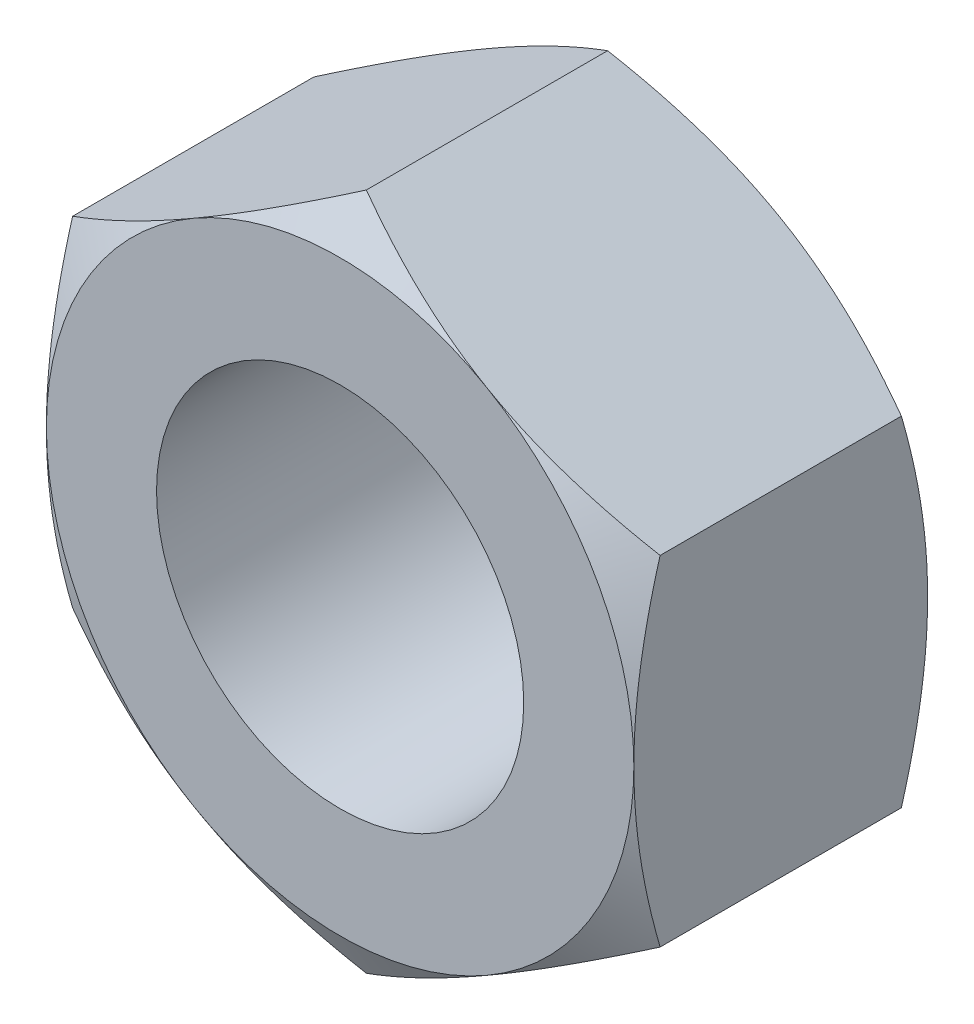
ISO-10303-21;
HEADER;
FILE_DESCRIPTION(('STEP AP214'),'2;1');
FILE_NAME('part.step','',(''),(''),'','','');
FILE_SCHEMA(('AUTOMOTIVE_DESIGN { 1 0 10303 214 1 1 1 1 }'));
ENDSEC;
DATA;
#1=APPLICATION_CONTEXT('core data for automotive mechanical design processes');
#2=APPLICATION_PROTOCOL_DEFINITION('international standard','automotive_design',2000,#1);
#3=PRODUCT_CONTEXT('',#1,'mechanical');
#4=PRODUCT('Part','Part','',(#3));
#5=PRODUCT_RELATED_PRODUCT_CATEGORY('part','',(#4));
#6=PRODUCT_DEFINITION_FORMATION('','',#4);
#7=PRODUCT_DEFINITION_CONTEXT('part definition',#1,'design');
#8=PRODUCT_DEFINITION('design','',#6,#7);
#9=PRODUCT_DEFINITION_SHAPE('','',#8);
#10=(LENGTH_UNIT() NAMED_UNIT(*) SI_UNIT(.MILLI.,.METRE.));
#11=(NAMED_UNIT(*) PLANE_ANGLE_UNIT() SI_UNIT($,.RADIAN.));
#12=(NAMED_UNIT(*) SI_UNIT($,.STERADIAN.) SOLID_ANGLE_UNIT());
#13=UNCERTAINTY_MEASURE_WITH_UNIT(LENGTH_MEASURE(1.E-05),#10,'distance_accuracy_value','');
#14=(GEOMETRIC_REPRESENTATION_CONTEXT(3) GLOBAL_UNCERTAINTY_ASSIGNED_CONTEXT((#13)) GLOBAL_UNIT_ASSIGNED_CONTEXT((#10,
#11,#12)) REPRESENTATION_CONTEXT('',''));
#15=CARTESIAN_POINT('',(0.,0.,0.));
#16=DIRECTION('',(0.,0.,1.));
#17=DIRECTION('',(1.,0.,0.));
#18=AXIS2_PLACEMENT_3D('',#15,#16,#17);
#19=CARTESIAN_POINT('',(-2.,-1.15470053837925,2.));
#20=DIRECTION('',(0.5,0.866025403784438,0.));
#21=DIRECTION('',(-0.866025403784439,0.5,0.));
#22=AXIS2_PLACEMENT_3D('',#19,#20,#21);
#23=PLANE('',#22);
#24=CARTESIAN_POINT('',(0.0002,-2.30951654681234,0.178699466620498));
#25=CARTESIAN_POINT('',(-0.0876912629000601,-2.25877250251758,0.149389536100679));
#26=CARTESIAN_POINT('',(-0.176341194473591,-2.20759044065996,0.122732851980467));
#27=CARTESIAN_POINT('',(-0.355176246997802,-2.10433997494456,0.0762024910207213));
#28=CARTESIAN_POINT('',(-0.445364546505036,-2.05226973594631,0.0563452763827794));
#29=CARTESIAN_POINT('',(-0.624623385763306,-1.94877459684592,0.0254334640232529));
#30=CARTESIAN_POINT('',(-0.713666338226304,-1.89736562427197,0.0141731515985315));
#31=CARTESIAN_POINT('',(-0.892171397785043,-1.79430568008402,0.000728662594642223));
#32=CARTESIAN_POINT('',(-0.981632855703958,-1.74265508327244,-0.00146664504653146));
#33=CARTESIAN_POINT('',(-1.1488083535488,-1.64613626458981,0.00309098933064913));
#34=CARTESIAN_POINT('',(-1.22654737026578,-1.60125362236173,0.0087248746870149));
#35=CARTESIAN_POINT('',(-1.38151891453613,-1.51178075956051,0.0265838952608285));
#36=CARTESIAN_POINT('',(-1.4587509057412,-1.46719084864821,0.0388151360234394));
#37=CARTESIAN_POINT('',(-1.6140421864822,-1.37753338590959,0.0693934368676097));
#38=CARTESIAN_POINT('',(-1.69208181310738,-1.33247718647009,0.0878701670657158));
#39=CARTESIAN_POINT('',(-1.84699686569213,-1.24303693915875,0.129805518212856));
#40=CARTESIAN_POINT('',(-1.92387427762312,-1.1986517446858,0.153254280492313));
#41=CARTESIAN_POINT('',(-2.0002,-1.15458506832541,0.178699466620497));
#42=B_SPLINE_CURVE_WITH_KNOTS('',3,(#24,#25,#26,#27,#28,#29,#30,#31,#32,#33,#34,#35,#36,#37,#38,
#39,#40,#41),.UNSPECIFIED.,.F.,.F.,(4,2,2,2,2,2,2,2,4),(0.,0.31703182469561,0.634825876346563,
0.944753967652636,1.25430138000371,1.52387047293094,1.79368946861028,2.06949491027634,
2.34475850821472),.UNSPECIFIED.);
#43=CARTESIAN_POINT('',(0.,-2.3094010767585,0.178632794954081));
#44=VERTEX_POINT('',#43);
#45=CARTESIAN_POINT('',(-1.,-1.73205080756888,0.));
#46=VERTEX_POINT('',#45);
#47=EDGE_CURVE('E266',#44,#46,#42,.T.);
#48=ORIENTED_EDGE('',*,*,#47,.F.);
#49=DIRECTION('',(0.,0.,-1.));
#50=VECTOR('',#49,1.);
#51=CARTESIAN_POINT('',(0.,-2.3094010767585,2.));
#52=LINE('',#51,#50);
#53=CARTESIAN_POINT('',(0.,-2.3094010767585,1.82136720504592));
#54=VERTEX_POINT('',#53);
#55=EDGE_CURVE('E309',#54,#44,#52,.T.);
#56=ORIENTED_EDGE('',*,*,#55,.F.);
#57=CARTESIAN_POINT('',(-2.0002,-1.15458506832541,1.8213005333795));
#58=CARTESIAN_POINT('',(-1.91230873709994,-1.20532911262018,1.85061046389932));
#59=CARTESIAN_POINT('',(-1.82365880552641,-1.2565111744778,1.87726714801953));
#60=CARTESIAN_POINT('',(-1.6448237530022,-1.35976164019319,1.92379750897928));
#61=CARTESIAN_POINT('',(-1.55463545349496,-1.41183187919145,1.94365472361722));
#62=CARTESIAN_POINT('',(-1.37537661423669,-1.51532701829183,1.97456653597675));
#63=CARTESIAN_POINT('',(-1.2863336617737,-1.56673599086578,1.98582684840147));
#64=CARTESIAN_POINT('',(-1.10782860221496,-1.66979593505373,1.99927133740536));
#65=CARTESIAN_POINT('',(-1.01836714429604,-1.72144653186531,2.00146664504653));
#66=CARTESIAN_POINT('',(-0.851191646451202,-1.81796535054794,1.99690901066935));
#67=CARTESIAN_POINT('',(-0.773452629734216,-1.86284799277603,1.99127512531299));
#68=CARTESIAN_POINT('',(-0.618481085463867,-1.95232085557725,1.97341610473917));
#69=CARTESIAN_POINT('',(-0.541249094258802,-1.99691076648954,1.96118486397656));
#70=CARTESIAN_POINT('',(-0.385957813517799,-2.08656822922816,1.93060656313239));
#71=CARTESIAN_POINT('',(-0.30791818689262,-2.13162442866767,1.91212983293428));
#72=CARTESIAN_POINT('',(-0.153003134307865,-2.221064675979,1.87019448178714));
#73=CARTESIAN_POINT('',(-0.0761257223768796,-2.26544987045196,1.84674571950769));
#74=CARTESIAN_POINT('',(0.000200000000000281,-2.30951654681234,1.8213005333795));
#75=B_SPLINE_CURVE_WITH_KNOTS('',3,(#57,#58,#59,#60,#61,#62,#63,#64,#65,#66,#67,#68,#69,#70,#71,
#72,#73,#74),.UNSPECIFIED.,.F.,.F.,(4,2,2,2,2,2,2,2,4),(0.,0.31703182469561,0.634825876346563,
0.944753967652636,1.25430138000371,1.52387047293094,1.79368946861028,2.06949491027634,
2.34475850821472),.UNSPECIFIED.);
#76=CARTESIAN_POINT('',(-1.,-1.73205080756888,2.));
#77=VERTEX_POINT('',#76);
#78=EDGE_CURVE('E216',#77,#54,#75,.T.);
#79=ORIENTED_EDGE('',*,*,#78,.F.);
#80=CARTESIAN_POINT('',(-2.,-1.15470053837931,1.82136720504596));
#81=VERTEX_POINT('',#80);
#82=EDGE_CURVE('E292',#81,#77,#75,.T.);
#83=ORIENTED_EDGE('',*,*,#82,.F.);
#84=DIRECTION('',(0.,0.,-1.));
#85=VECTOR('',#84,1.);
#86=CARTESIAN_POINT('',(-2.,-1.15470053837925,2.));
#87=LINE('',#86,#85);
#88=CARTESIAN_POINT('',(-2.,-1.15470053837931,0.178632794954043));
#89=VERTEX_POINT('',#88);
#90=EDGE_CURVE('E289',#81,#89,#87,.T.);
#91=ORIENTED_EDGE('',*,*,#90,.T.);
#92=EDGE_CURVE('E253',#46,#89,#42,.T.);
#93=ORIENTED_EDGE('',*,*,#92,.F.);
#94=EDGE_LOOP('',(#48,#56,#79,#83,#91,#93));
#95=FACE_BOUND('',#94,.T.);
#96=ADVANCED_FACE('F36',(#95),#23,.F.);
#97=CARTESIAN_POINT('',(0.,-2.3094010767585,2.));
#98=DIRECTION('',(-0.5,0.866025403784439,0.));
#99=DIRECTION('',(-0.866025403784439,-0.5,0.));
#100=AXIS2_PLACEMENT_3D('',#97,#98,#99);
#101=PLANE('',#100);
#102=CARTESIAN_POINT('',(2.0002,-1.15458506832541,0.178699466620498));
#103=CARTESIAN_POINT('',(1.91230873709994,-1.20532911262018,0.149389536100679));
#104=CARTESIAN_POINT('',(1.82365880552641,-1.2565111744778,0.122732851980467));
#105=CARTESIAN_POINT('',(1.6448237530022,-1.35976164019319,0.0762024910207212));
#106=CARTESIAN_POINT('',(1.55463545349496,-1.41183187919145,0.0563452763827793));
#107=CARTESIAN_POINT('',(1.37537661423669,-1.51532701829183,0.0254334640232528));
#108=CARTESIAN_POINT('',(1.2863336617737,-1.56673599086578,0.0141731515985315));
#109=CARTESIAN_POINT('',(1.10782860221496,-1.66979593505373,0.000728662594642224));
#110=CARTESIAN_POINT('',(1.01836714429604,-1.72144653186531,-0.0014666450465315));
#111=CARTESIAN_POINT('',(0.851191646451202,-1.81796535054794,0.00309098933064922));
#112=CARTESIAN_POINT('',(0.773452629734216,-1.86284799277603,0.00872487468701516));
#113=CARTESIAN_POINT('',(0.618481085463867,-1.95232085557725,0.0265838952608289));
#114=CARTESIAN_POINT('',(0.541249094258802,-1.99691076648954,0.0388151360234398));
#115=CARTESIAN_POINT('',(0.385957813517799,-2.08656822922816,0.0693934368676101));
#116=CARTESIAN_POINT('',(0.307918186892621,-2.13162442866767,0.0878701670657161));
#117=CARTESIAN_POINT('',(0.153003134307865,-2.221064675979,0.129805518212856));
#118=CARTESIAN_POINT('',(0.0761257223768798,-2.26544987045196,0.153254280492314));
#119=CARTESIAN_POINT('',(-0.000200000000000301,-2.30951654681234,0.178699466620498));
#120=B_SPLINE_CURVE_WITH_KNOTS('',3,(#102,#103,#104,#105,#106,#107,#108,#109,#110,#111,#112,
#113,#114,#115,#116,#117,#118,#119),.UNSPECIFIED.,.F.,.F.,(4,2,2,2,2,2,2,2,4),(0.,
0.31703182469561,0.634825876346563,0.944753967652636,1.25430138000371,1.52387047293094,
1.79368946861028,2.06949491027634,2.34475850821472),.UNSPECIFIED.);
#121=CARTESIAN_POINT('',(2.,-1.15470053837925,0.178632794954081));
#122=VERTEX_POINT('',#121);
#123=CARTESIAN_POINT('',(1.,-1.73205080756888,0.));
#124=VERTEX_POINT('',#123);
#125=EDGE_CURVE('E144',#122,#124,#120,.T.);
#126=ORIENTED_EDGE('',*,*,#125,.F.);
#127=DIRECTION('',(0.,0.,-1.));
#128=VECTOR('',#127,1.);
#129=CARTESIAN_POINT('',(2.,-1.15470053837925,2.));
#130=LINE('',#129,#128);
#131=CARTESIAN_POINT('',(2.,-1.15470053837931,1.82136720504596));
#132=VERTEX_POINT('',#131);
#133=EDGE_CURVE('E156',#132,#122,#130,.T.);
#134=ORIENTED_EDGE('',*,*,#133,.F.);
#135=CARTESIAN_POINT('',(-0.000200000000000067,-2.30951654681234,1.8213005333795));
#136=CARTESIAN_POINT('',(0.0876912629000601,-2.25877250251758,1.85061046389932));
#137=CARTESIAN_POINT('',(0.176341194473591,-2.20759044065996,1.87726714801953));
#138=CARTESIAN_POINT('',(0.355176246997802,-2.10433997494456,1.92379750897928));
#139=CARTESIAN_POINT('',(0.445364546505036,-2.05226973594631,1.94365472361722));
#140=CARTESIAN_POINT('',(0.624623385763306,-1.94877459684592,1.97456653597675));
#141=CARTESIAN_POINT('',(0.713666338226304,-1.89736562427197,1.98582684840147));
#142=CARTESIAN_POINT('',(0.892171397785043,-1.79430568008402,1.99927133740536));
#143=CARTESIAN_POINT('',(0.981632855703958,-1.74265508327244,2.00146664504653));
#144=CARTESIAN_POINT('',(1.1488083535488,-1.64613626458981,1.99690901066935));
#145=CARTESIAN_POINT('',(1.22654737026578,-1.60125362236173,1.99127512531299));
#146=CARTESIAN_POINT('',(1.38151891453613,-1.51178075956051,1.97341610473917));
#147=CARTESIAN_POINT('',(1.4587509057412,-1.46719084864821,1.96118486397656));
#148=CARTESIAN_POINT('',(1.6140421864822,-1.37753338590959,1.93060656313239));
#149=CARTESIAN_POINT('',(1.69208181310738,-1.33247718647009,1.91212983293428));
#150=CARTESIAN_POINT('',(1.84699686569214,-1.24303693915875,1.87019448178714));
#151=CARTESIAN_POINT('',(1.92387427762312,-1.1986517446858,1.84674571950769));
#152=CARTESIAN_POINT('',(2.0002,-1.15458506832541,1.8213005333795));
#153=B_SPLINE_CURVE_WITH_KNOTS('',3,(#135,#136,#137,#138,#139,#140,#141,#142,#143,#144,#145,
#146,#147,#148,#149,#150,#151,#152),.UNSPECIFIED.,.F.,.F.,(4,2,2,2,2,2,2,2,4),(0.,
0.31703182469561,0.634825876346563,0.944753967652636,1.25430138000371,1.52387047293094,
1.79368946861028,2.06949491027634,2.34475850821472),.UNSPECIFIED.);
#154=CARTESIAN_POINT('',(1.,-1.73205080756888,2.));
#155=VERTEX_POINT('',#154);
#156=EDGE_CURVE('E199',#155,#132,#153,.T.);
#157=ORIENTED_EDGE('',*,*,#156,.F.);
#158=EDGE_CURVE('E333',#54,#155,#153,.T.);
#159=ORIENTED_EDGE('',*,*,#158,.F.);
#160=ORIENTED_EDGE('',*,*,#55,.T.);
#161=EDGE_CURVE('E166',#124,#44,#120,.T.);
#162=ORIENTED_EDGE('',*,*,#161,.F.);
#163=EDGE_LOOP('',(#126,#134,#157,#159,#160,#162));
#164=FACE_BOUND('',#163,.T.);
#165=ADVANCED_FACE('F179',(#164),#101,.F.);
#166=CARTESIAN_POINT('',(2.,-1.15470053837925,2.));
#167=DIRECTION('',(-1.,0.,0.));
#168=DIRECTION('',(0.,-1.,0.));
#169=AXIS2_PLACEMENT_3D('',#166,#167,#168);
#170=PLANE('',#169);
#171=CARTESIAN_POINT('',(2.,-3.16695367197543,1.00782850269269));
#172=CARTESIAN_POINT('',(2.,-3.07902197526416,0.96491529338985));
#173=CARTESIAN_POINT('',(2.,-2.9908952827537,0.922395125991094));
#174=CARTESIAN_POINT('',(2.,-2.81414842644907,0.8383607333178));
#175=CARTESIAN_POINT('',(2.,-2.72552819295827,0.796846654790504));
#176=CARTESIAN_POINT('',(2.,-2.54726481378445,0.714849235448644));
#177=CARTESIAN_POINT('',(2.,-2.45761875900125,0.67437219827092));
#178=CARTESIAN_POINT('',(2.,-2.2776359990054,0.594989901598798));
#179=CARTESIAN_POINT('',(2.,-2.18729932484827,0.556084571917135));
#180=CARTESIAN_POINT('',(2.,-2.00264742283372,0.478944987647855));
#181=CARTESIAN_POINT('',(2.,-1.90830280795076,0.44078071061596));
#182=CARTESIAN_POINT('',(2.,-1.71855244896371,0.367193126153302));
#183=CARTESIAN_POINT('',(2.,-1.62314679567917,0.331769586163279));
#184=CARTESIAN_POINT('',(2.,-1.43125371410594,0.26453421181959));
#185=CARTESIAN_POINT('',(2.,-1.33476856464363,0.232715936188967));
#186=CARTESIAN_POINT('',(2.,-1.1404157757171,0.173672468100185));
#187=CARTESIAN_POINT('',(2.,-1.04254856096067,0.146445896525398));
#188=CARTESIAN_POINT('',(2.,-0.845921788600807,0.097994569131326));
#189=CARTESIAN_POINT('',(2.,-0.747170823197166,0.0767355710741393));
#190=CARTESIAN_POINT('',(2.,-0.548376289196544,0.0413752685656705));
#191=CARTESIAN_POINT('',(2.,-0.448332866747864,0.0272731619685154));
#192=CARTESIAN_POINT('',(2.,-0.248781070375196,0.00753603700427049));
#193=CARTESIAN_POINT('',(2.,-0.149284287500364,0.00178714028607804));
#194=CARTESIAN_POINT('',(2.,0.0498326704758066,-0.00107345626728786));
#195=CARTESIAN_POINT('',(2.,0.149452846859733,0.0018149344419635));
#196=CARTESIAN_POINT('',(2.,0.38462284335751,0.018587327234583));
#197=CARTESIAN_POINT('',(2.,0.51991483609575,0.0361239388912121));
#198=CARTESIAN_POINT('',(2.,0.788159784938836,0.084225245542518));
#199=CARTESIAN_POINT('',(2.,0.921110572606416,0.114801418471631));
#200=CARTESIAN_POINT('',(2.,1.18747685717518,0.186425271558098));
#201=CARTESIAN_POINT('',(2.,1.32082859088601,0.227704106094186));
#202=CARTESIAN_POINT('',(2.,1.51898260167282,0.294951393872946));
#203=CARTESIAN_POINT('',(2.,1.58471745406577,0.318253638255043));
#204=CARTESIAN_POINT('',(2.,1.71563585585812,0.366357752672725));
#205=CARTESIAN_POINT('',(2.,1.78081941929029,0.391159584405357));
#206=CARTESIAN_POINT('',(2.,1.96047132737881,0.461501040171776));
#207=CARTESIAN_POINT('',(2.,2.07442009684161,0.508364702088242));
#208=CARTESIAN_POINT('',(2.,2.30109986654163,0.604960958336492));
#209=CARTESIAN_POINT('',(2.,2.41383071836308,0.654693897740062));
#210=CARTESIAN_POINT('',(2.,2.63836009784249,0.756327584044141));
#211=CARTESIAN_POINT('',(2.,2.7501582470185,0.808229164085102));
#212=CARTESIAN_POINT('',(2.,2.97297822080944,0.913676041673371));
#213=CARTESIAN_POINT('',(2.,3.0840000198922,0.967221392970891));
#214=CARTESIAN_POINT('',(2.,3.41651309377542,1.1299289124428));
#215=CARTESIAN_POINT('',(2.,3.63707460518763,1.24098839062516));
#216=CARTESIAN_POINT('',(2.,4.07651788965889,1.46623320547477));
#217=CARTESIAN_POINT('',(2.,4.29540004090732,1.58041781023684));
#218=CARTESIAN_POINT('',(2.,4.70796742449767,1.79819557381208));
#219=CARTESIAN_POINT('',(2.,4.90176934503598,1.90156804689578));
#220=CARTESIAN_POINT('',(2.,5.28873234168865,2.10953519768183));
#221=CARTESIAN_POINT('',(2.,5.48189337289715,2.21412995879868));
#222=CARTESIAN_POINT('',(2.,5.86703603383661,2.42384733635444));
#223=CARTESIAN_POINT('',(2.,6.05901941340968,2.52896674297787));
#224=CARTESIAN_POINT('',(2.,6.44258645794321,2.73989383988691));
#225=CARTESIAN_POINT('',(2.,6.63417015570406,2.84570147050149));
#226=CARTESIAN_POINT('',(2.,6.82561474984265,2.951758468002));
#227=B_SPLINE_CURVE_WITH_KNOTS('',3,(#171,#172,#173,#174,#175,#176,#177,#178,#179,#180,#181,
#182,#183,#184,#185,#186,#187,#188,#189,#190,#191,#192,#193,#194,#195,#196,#197,#198,#199,#200,
#201,#202,#203,#204,#205,#206,#207,#208,#209,#210,#211,#212,#213,#214,#215,#216,#217,#218,#219,
#220,#221,#222,#223,#224,#225,#226),.UNSPECIFIED.,.F.,.F.,(4,2,2,2,2,2,2,2,2,2,2,2,2,2,2,2,2,2,
2,2,2,2,2,2,2,2,2,4),(0.,0.293536488763143,0.587115537909024,0.882185192506168,1.17724165566855,
1.48252306859444,1.78777854905824,2.09247975206599,2.39708927456178,2.69991343430837,
3.00270364596081,3.3013259173142,3.59995131912687,4.00838273527675,4.41717441329802,
4.83566143161901,5.04487769482538,5.25408861641711,5.62365791707084,5.99327175676164,
6.36302892297546,6.73279819290498,7.47358342922537,8.21419663356501,8.87313329090316,
9.5321151827856,10.1887484805853,10.8453255857258),.UNSPECIFIED.);
#228=CARTESIAN_POINT('',(2.,1.15470053837925,0.178632794954081));
#229=VERTEX_POINT('',#228);
#230=CARTESIAN_POINT('',(2.,0.,0.));
#231=VERTEX_POINT('',#230);
#232=EDGE_CURVE('E125',#229,#231,#227,.F.);
#233=ORIENTED_EDGE('',*,*,#232,.F.);
#234=DIRECTION('',(0.,0.,-1.));
#235=VECTOR('',#234,1.);
#236=CARTESIAN_POINT('',(2.,1.15470053837925,2.));
#237=LINE('',#236,#235);
#238=CARTESIAN_POINT('',(2.,1.15470053837925,1.82136720504592));
#239=VERTEX_POINT('',#238);
#240=EDGE_CURVE('E307',#239,#229,#237,.T.);
#241=ORIENTED_EDGE('',*,*,#240,.F.);
#242=CARTESIAN_POINT('',(2.,-3.16695367197542,0.992171497307313));
#243=CARTESIAN_POINT('',(2.,-3.07902197526416,1.03508470661015));
#244=CARTESIAN_POINT('',(2.,-2.9908952827537,1.07760487400891));
#245=CARTESIAN_POINT('',(2.,-2.81414842644907,1.1616392666822));
#246=CARTESIAN_POINT('',(2.,-2.72552819295827,1.2031533452095));
#247=CARTESIAN_POINT('',(2.,-2.54726481378445,1.28515076455136));
#248=CARTESIAN_POINT('',(2.,-2.45761875900125,1.32562780172908));
#249=CARTESIAN_POINT('',(2.,-2.2776359990054,1.4050100984012));
#250=CARTESIAN_POINT('',(2.,-2.18729932484826,1.44391542808287));
#251=CARTESIAN_POINT('',(2.,-2.00264742283371,1.52105501235215));
#252=CARTESIAN_POINT('',(2.,-1.90830280795076,1.55921928938404));
#253=CARTESIAN_POINT('',(2.,-1.71855244896371,1.6328068738467));
#254=CARTESIAN_POINT('',(2.,-1.62314679567917,1.66823041383672));
#255=CARTESIAN_POINT('',(2.,-1.43125371410594,1.73546578818041));
#256=CARTESIAN_POINT('',(2.,-1.33476856464363,1.76728406381103));
#257=CARTESIAN_POINT('',(2.,-1.1404157757171,1.82632753189982));
#258=CARTESIAN_POINT('',(2.,-1.04254856096067,1.8535541034746));
#259=CARTESIAN_POINT('',(2.,-0.845921788600806,1.90200543086867));
#260=CARTESIAN_POINT('',(2.,-0.747170823197165,1.92326442892586));
#261=CARTESIAN_POINT('',(2.,-0.548376289196544,1.95862473143433));
#262=CARTESIAN_POINT('',(2.,-0.448332866747864,1.97272683803148));
#263=CARTESIAN_POINT('',(2.,-0.248781070375196,1.99246396299573));
#264=CARTESIAN_POINT('',(2.,-0.149284287500364,1.99821285971392));
#265=CARTESIAN_POINT('',(2.,0.0498326704758063,2.00107345626729));
#266=CARTESIAN_POINT('',(2.,0.149452846859732,1.99818506555804));
#267=CARTESIAN_POINT('',(2.,0.38462284335751,1.98141267276542));
#268=CARTESIAN_POINT('',(2.,0.51991483609575,1.96387606110879));
#269=CARTESIAN_POINT('',(2.,0.788159784938835,1.91577475445748));
#270=CARTESIAN_POINT('',(2.,0.921110572606415,1.88519858152837));
#271=CARTESIAN_POINT('',(2.,1.18747685717518,1.8135747284419));
#272=CARTESIAN_POINT('',(2.,1.32082859088601,1.77229589390581));
#273=CARTESIAN_POINT('',(2.,1.51898260167282,1.70504860612706));
#274=CARTESIAN_POINT('',(2.,1.58471745406577,1.68174636174496));
#275=CARTESIAN_POINT('',(2.,1.71563585585812,1.63364224732728));
#276=CARTESIAN_POINT('',(2.,1.78081941929029,1.60884041559464));
#277=CARTESIAN_POINT('',(2.,1.96047132737881,1.53849895982823));
#278=CARTESIAN_POINT('',(2.,2.07442009684161,1.49163529791176));
#279=CARTESIAN_POINT('',(2.,2.30109986654162,1.39503904166351));
#280=CARTESIAN_POINT('',(2.,2.41383071836308,1.34530610225994));
#281=CARTESIAN_POINT('',(2.,2.63836009784249,1.24367241595586));
#282=CARTESIAN_POINT('',(2.,2.75015824701849,1.1917708359149));
#283=CARTESIAN_POINT('',(2.,2.97297822080944,1.08632395832663));
#284=CARTESIAN_POINT('',(2.,3.0840000198922,1.03277860702911));
#285=CARTESIAN_POINT('',(2.,3.41651309377542,0.870071087557202));
#286=CARTESIAN_POINT('',(2.,3.63707460518762,0.759011609374839));
#287=CARTESIAN_POINT('',(2.,4.07651788965889,0.53376679452523));
#288=CARTESIAN_POINT('',(2.,4.29540004090732,0.419582189763159));
#289=CARTESIAN_POINT('',(2.,4.70796742449767,0.201804426187924));
#290=CARTESIAN_POINT('',(2.,4.90176934503598,0.0984319531042194));
#291=CARTESIAN_POINT('',(2.,5.28873234168865,-0.109535197681831));
#292=CARTESIAN_POINT('',(2.,5.48189337289715,-0.214129958798676));
#293=CARTESIAN_POINT('',(2.,5.86703603383661,-0.423847336354435));
#294=CARTESIAN_POINT('',(2.,6.05901941340968,-0.528966742977868));
#295=CARTESIAN_POINT('',(2.,6.44258645794321,-0.73989383988691));
#296=CARTESIAN_POINT('',(2.,6.63417015570406,-0.845701470501486));
#297=CARTESIAN_POINT('',(2.,6.82561474984265,-0.951758468002002));
#298=B_SPLINE_CURVE_WITH_KNOTS('',3,(#242,#243,#244,#245,#246,#247,#248,#249,#250,#251,#252,
#253,#254,#255,#256,#257,#258,#259,#260,#261,#262,#263,#264,#265,#266,#267,#268,#269,#270,#271,
#272,#273,#274,#275,#276,#277,#278,#279,#280,#281,#282,#283,#284,#285,#286,#287,#288,#289,#290,
#291,#292,#293,#294,#295,#296,#297),.UNSPECIFIED.,.F.,.F.,(4,2,2,2,2,2,2,2,2,2,2,2,2,2,2,2,2,2,
2,2,2,2,2,2,2,2,2,4),(0.,0.293536488763143,0.587115537909024,0.882185192506167,1.17724165566855,
1.48252306859444,1.78777854905824,2.09247975206599,2.39708927456178,2.69991343430837,
3.00270364596081,3.3013259173142,3.59995131912687,4.00838273527675,4.41717441329801,
4.83566143161901,5.04487769482538,5.2540886164171,5.62365791707083,5.99327175676164,
6.36302892297545,6.73279819290497,7.47358342922536,8.21419663356501,8.87313329090316,
9.5321151827856,10.1887484805853,10.8453255857258),.UNSPECIFIED.);
#299=CARTESIAN_POINT('',(2.,0.,2.));
#300=VERTEX_POINT('',#299);
#301=EDGE_CURVE('E185',#300,#239,#298,.T.);
#302=ORIENTED_EDGE('',*,*,#301,.F.);
#303=EDGE_CURVE('E192',#132,#300,#298,.T.);
#304=ORIENTED_EDGE('',*,*,#303,.F.);
#305=ORIENTED_EDGE('',*,*,#133,.T.);
#306=EDGE_CURVE('E137',#231,#122,#227,.F.);
#307=ORIENTED_EDGE('',*,*,#306,.F.);
#308=EDGE_LOOP('',(#233,#241,#302,#304,#305,#307));
#309=FACE_BOUND('',#308,.T.);
#310=ADVANCED_FACE('F153',(#309),#170,.F.);
#311=CARTESIAN_POINT('',(2.,1.15470053837925,2.));
#312=DIRECTION('',(-0.5,-0.866025403784439,0.));
#313=DIRECTION('',(0.866025403784439,-0.5,0.));
#314=AXIS2_PLACEMENT_3D('',#311,#312,#313);
#315=PLANE('',#314);
#316=CARTESIAN_POINT('',(-0.000200000000000025,2.30951654681234,0.178699466620498));
#317=CARTESIAN_POINT('',(0.0876912629000598,2.25877250251758,0.149389536100679));
#318=CARTESIAN_POINT('',(0.176341194473591,2.20759044065996,0.122732851980467));
#319=CARTESIAN_POINT('',(0.355176246997802,2.10433997494456,0.0762024910207213));
#320=CARTESIAN_POINT('',(0.445364546505036,2.05226973594631,0.0563452763827795));
#321=CARTESIAN_POINT('',(0.624623385763306,1.94877459684592,0.0254334640232531));
#322=CARTESIAN_POINT('',(0.713666338226304,1.89736562427197,0.0141731515985317));
#323=CARTESIAN_POINT('',(0.892171397785043,1.79430568008402,0.000728662594642475));
#324=CARTESIAN_POINT('',(0.981632855703958,1.74265508327244,-0.00146664504653129));
#325=CARTESIAN_POINT('',(1.1488083535488,1.64613626458981,0.00309098933064933));
#326=CARTESIAN_POINT('',(1.22654737026578,1.60125362236173,0.0087248746870152));
#327=CARTESIAN_POINT('',(1.38151891453613,1.51178075956051,0.0265838952608289));
#328=CARTESIAN_POINT('',(1.4587509057412,1.46719084864821,0.0388151360234397));
#329=CARTESIAN_POINT('',(1.6140421864822,1.37753338590959,0.0693934368676099));
#330=CARTESIAN_POINT('',(1.69208181310738,1.33247718647009,0.087870167065716));
#331=CARTESIAN_POINT('',(1.84699686569213,1.24303693915876,0.129805518212856));
#332=CARTESIAN_POINT('',(1.92387427762312,1.1986517446858,0.153254280492313));
#333=CARTESIAN_POINT('',(2.0002,1.15458506832542,0.178699466620498));
#334=B_SPLINE_CURVE_WITH_KNOTS('',3,(#316,#317,#318,#319,#320,#321,#322,#323,#324,#325,#326,
#327,#328,#329,#330,#331,#332,#333),.UNSPECIFIED.,.F.,.F.,(4,2,2,2,2,2,2,2,4),(0.,
0.31703182469561,0.634825876346563,0.944753967652636,1.25430138000371,1.52387047293094,
1.79368946861028,2.06949491027634,2.34475850821472),.UNSPECIFIED.);
#335=CARTESIAN_POINT('',(0.,2.3094010767585,0.178632794954081));
#336=VERTEX_POINT('',#335);
#337=CARTESIAN_POINT('',(1.,1.73205080756888,0.));
#338=VERTEX_POINT('',#337);
#339=EDGE_CURVE('E52',#336,#338,#334,.T.);
#340=ORIENTED_EDGE('',*,*,#339,.F.);
#341=DIRECTION('',(0.,0.,-1.));
#342=VECTOR('',#341,1.);
#343=CARTESIAN_POINT('',(0.,2.3094010767585,2.));
#344=LINE('',#343,#342);
#345=CARTESIAN_POINT('',(0.,2.3094010767585,1.82136720504592));
#346=VERTEX_POINT('',#345);
#347=EDGE_CURVE('E299',#346,#336,#344,.T.);
#348=ORIENTED_EDGE('',*,*,#347,.F.);
#349=CARTESIAN_POINT('',(2.0002,1.15458506832541,1.8213005333795));
#350=CARTESIAN_POINT('',(1.91230873709994,1.20532911262018,1.85061046389932));
#351=CARTESIAN_POINT('',(1.82365880552641,1.2565111744778,1.87726714801953));
#352=CARTESIAN_POINT('',(1.6448237530022,1.35976164019319,1.92379750897928));
#353=CARTESIAN_POINT('',(1.55463545349496,1.41183187919145,1.94365472361722));
#354=CARTESIAN_POINT('',(1.37537661423669,1.51532701829183,1.97456653597675));
#355=CARTESIAN_POINT('',(1.2863336617737,1.56673599086578,1.98582684840147));
#356=CARTESIAN_POINT('',(1.10782860221496,1.66979593505373,1.99927133740536));
#357=CARTESIAN_POINT('',(1.01836714429604,1.72144653186531,2.00146664504653));
#358=CARTESIAN_POINT('',(0.851191646451201,1.81796535054794,1.99690901066935));
#359=CARTESIAN_POINT('',(0.773452629734216,1.86284799277603,1.99127512531299));
#360=CARTESIAN_POINT('',(0.618481085463866,1.95232085557725,1.97341610473917));
#361=CARTESIAN_POINT('',(0.541249094258801,1.99691076648954,1.96118486397656));
#362=CARTESIAN_POINT('',(0.385957813517799,2.08656822922816,1.93060656313239));
#363=CARTESIAN_POINT('',(0.30791818689262,2.13162442866767,1.91212983293428));
#364=CARTESIAN_POINT('',(0.153003134307865,2.221064675979,1.87019448178714));
#365=CARTESIAN_POINT('',(0.0761257223768797,2.26544987045196,1.84674571950769));
#366=CARTESIAN_POINT('',(-0.000200000000000167,2.30951654681234,1.8213005333795));
#367=B_SPLINE_CURVE_WITH_KNOTS('',3,(#349,#350,#351,#352,#353,#354,#355,#356,#357,#358,#359,
#360,#361,#362,#363,#364,#365,#366),.UNSPECIFIED.,.F.,.F.,(4,2,2,2,2,2,2,2,4),(0.,
0.31703182469561,0.634825876346563,0.944753967652635,1.25430138000371,1.52387047293094,
1.79368946861028,2.06949491027634,2.34475850821472),.UNSPECIFIED.);
#368=CARTESIAN_POINT('',(1.,1.73205080756888,2.));
#369=VERTEX_POINT('',#368);
#370=EDGE_CURVE('E194',#369,#346,#367,.T.);
#371=ORIENTED_EDGE('',*,*,#370,.F.);
#372=EDGE_CURVE('E193',#239,#369,#367,.T.);
#373=ORIENTED_EDGE('',*,*,#372,.F.);
#374=ORIENTED_EDGE('',*,*,#240,.T.);
#375=EDGE_CURVE('E131',#338,#229,#334,.T.);
#376=ORIENTED_EDGE('',*,*,#375,.F.);
#377=EDGE_LOOP('',(#340,#348,#371,#373,#374,#376));
#378=FACE_BOUND('',#377,.T.);
#379=ADVANCED_FACE('F178',(#378),#315,.F.);
#380=CARTESIAN_POINT('',(0.,2.3094010767585,2.));
#381=DIRECTION('',(0.5,-0.866025403784439,0.));
#382=DIRECTION('',(0.866025403784439,0.5,0.));
#383=AXIS2_PLACEMENT_3D('',#380,#381,#382);
#384=PLANE('',#383);
#385=CARTESIAN_POINT('',(-2.0002,1.15458506832541,0.178699466620498));
#386=CARTESIAN_POINT('',(-1.91230873709994,1.20532911262018,0.149389536100679));
#387=CARTESIAN_POINT('',(-1.82365880552641,1.2565111744778,0.122732851980467));
#388=CARTESIAN_POINT('',(-1.6448237530022,1.35976164019319,0.0762024910207214));
#389=CARTESIAN_POINT('',(-1.55463545349496,1.41183187919145,0.0563452763827797));
#390=CARTESIAN_POINT('',(-1.37537661423669,1.51532701829183,0.025433464023253));
#391=CARTESIAN_POINT('',(-1.2863336617737,1.56673599086578,0.0141731515985315));
#392=CARTESIAN_POINT('',(-1.10782860221496,1.66979593505373,0.000728662594642247));
#393=CARTESIAN_POINT('',(-1.01836714429604,1.72144653186531,-0.0014666450465312));
#394=CARTESIAN_POINT('',(-0.851191646451202,1.81796535054794,0.00309098933064949));
#395=CARTESIAN_POINT('',(-0.773452629734216,1.86284799277603,0.00872487468701519));
#396=CARTESIAN_POINT('',(-0.618481085463867,1.95232085557725,0.0265838952608289));
#397=CARTESIAN_POINT('',(-0.541249094258801,1.99691076648954,0.0388151360234398));
#398=CARTESIAN_POINT('',(-0.385957813517799,2.08656822922816,0.0693934368676102));
#399=CARTESIAN_POINT('',(-0.307918186892621,2.13162442866767,0.0878701670657161));
#400=CARTESIAN_POINT('',(-0.153003134307866,2.221064675979,0.129805518212856));
#401=CARTESIAN_POINT('',(-0.0761257223768801,2.26544987045196,0.153254280492313));
#402=CARTESIAN_POINT('',(0.000199999999999929,2.30951654681234,0.178699466620498));
#403=B_SPLINE_CURVE_WITH_KNOTS('',3,(#385,#386,#387,#388,#389,#390,#391,#392,#393,#394,#395,
#396,#397,#398,#399,#400,#401,#402),.UNSPECIFIED.,.F.,.F.,(4,2,2,2,2,2,2,2,4),(0.,
0.31703182469561,0.634825876346563,0.944753967652636,1.25430138000371,1.52387047293094,
1.79368946861028,2.06949491027634,2.34475850821472),.UNSPECIFIED.);
#404=CARTESIAN_POINT('',(-2.,1.15470053837925,0.178632794954081));
#405=VERTEX_POINT('',#404);
#406=CARTESIAN_POINT('',(-1.,1.73205080756888,0.));
#407=VERTEX_POINT('',#406);
#408=EDGE_CURVE('E59',#405,#407,#403,.T.);
#409=ORIENTED_EDGE('',*,*,#408,.F.);
#410=DIRECTION('',(0.,0.,-1.));
#411=VECTOR('',#410,1.);
#412=CARTESIAN_POINT('',(-2.,1.15470053837925,2.));
#413=LINE('',#412,#411);
#414=CARTESIAN_POINT('',(-2.,1.15470053837925,1.82136720504592));
#415=VERTEX_POINT('',#414);
#416=EDGE_CURVE('E295',#415,#405,#413,.T.);
#417=ORIENTED_EDGE('',*,*,#416,.F.);
#418=CARTESIAN_POINT('',(0.000200000000000042,2.30951654681234,1.8213005333795));
#419=CARTESIAN_POINT('',(-0.0876912629000598,2.25877250251758,1.85061046389932));
#420=CARTESIAN_POINT('',(-0.176341194473591,2.20759044065996,1.87726714801953));
#421=CARTESIAN_POINT('',(-0.355176246997802,2.10433997494456,1.92379750897928));
#422=CARTESIAN_POINT('',(-0.445364546505036,2.05226973594631,1.94365472361722));
#423=CARTESIAN_POINT('',(-0.624623385763306,1.94877459684592,1.97456653597675));
#424=CARTESIAN_POINT('',(-0.713666338226304,1.89736562427197,1.98582684840147));
#425=CARTESIAN_POINT('',(-0.892171397785043,1.79430568008402,1.99927133740536));
#426=CARTESIAN_POINT('',(-0.981632855703958,1.74265508327244,2.00146664504653));
#427=CARTESIAN_POINT('',(-1.1488083535488,1.64613626458981,1.99690901066935));
#428=CARTESIAN_POINT('',(-1.22654737026578,1.60125362236173,1.99127512531298));
#429=CARTESIAN_POINT('',(-1.38151891453613,1.51178075956051,1.97341610473917));
#430=CARTESIAN_POINT('',(-1.4587509057412,1.46719084864821,1.96118486397656));
#431=CARTESIAN_POINT('',(-1.6140421864822,1.37753338590959,1.93060656313239));
#432=CARTESIAN_POINT('',(-1.69208181310738,1.33247718647009,1.91212983293428));
#433=CARTESIAN_POINT('',(-1.84699686569213,1.24303693915875,1.87019448178714));
#434=CARTESIAN_POINT('',(-1.92387427762312,1.1986517446858,1.84674571950769));
#435=CARTESIAN_POINT('',(-2.0002,1.15458506832541,1.8213005333795));
#436=B_SPLINE_CURVE_WITH_KNOTS('',3,(#418,#419,#420,#421,#422,#423,#424,#425,#426,#427,#428,
#429,#430,#431,#432,#433,#434,#435),.UNSPECIFIED.,.F.,.F.,(4,2,2,2,2,2,2,2,4),(0.,
0.31703182469561,0.634825876346563,0.944753967652635,1.25430138000371,1.52387047293094,
1.79368946861028,2.06949491027634,2.34475850821472),.UNSPECIFIED.);
#437=CARTESIAN_POINT('',(-1.,1.73205080756888,2.));
#438=VERTEX_POINT('',#437);
#439=EDGE_CURVE('E232',#438,#415,#436,.T.);
#440=ORIENTED_EDGE('',*,*,#439,.F.);
#441=EDGE_CURVE('E237',#346,#438,#436,.T.);
#442=ORIENTED_EDGE('',*,*,#441,.F.);
#443=ORIENTED_EDGE('',*,*,#347,.T.);
#444=EDGE_CURVE('E255',#407,#336,#403,.T.);
#445=ORIENTED_EDGE('',*,*,#444,.F.);
#446=EDGE_LOOP('',(#409,#417,#440,#442,#443,#445));
#447=FACE_BOUND('',#446,.T.);
#448=ADVANCED_FACE('F238',(#447),#384,.F.);
#449=CARTESIAN_POINT('',(-2.,1.15470053837925,2.));
#450=DIRECTION('',(1.,0.,0.));
#451=DIRECTION('',(0.,1.,0.));
#452=AXIS2_PLACEMENT_3D('',#449,#450,#451);
#453=PLANE('',#452);
#454=CARTESIAN_POINT('',(-2.,-3.16695366774632,1.00782850062823));
#455=CARTESIAN_POINT('',(-2.,-3.07902197117755,0.964915291411256));
#456=CARTESIAN_POINT('',(-2.,-2.99089527880967,0.922395124098318));
#457=CARTESIAN_POINT('',(-2.,-2.81414842279064,0.838360731596246));
#458=CARTESIAN_POINT('',(-2.,-2.72552818944284,0.796846653154353));
#459=CARTESIAN_POINT('',(-2.,-2.54726481055715,0.714849233983328));
#460=CARTESIAN_POINT('',(-2.,-2.45761875591907,0.674372196891021));
#461=CARTESIAN_POINT('',(-2.,-2.27763599621444,0.59498990038834));
#462=CARTESIAN_POINT('',(-2.,-2.18729932220339,0.556084570790703));
#463=CARTESIAN_POINT('',(-2.,-2.00264742049299,0.478944986692281));
#464=CARTESIAN_POINT('',(-2.,-1.90830280576821,0.440780709747013));
#465=CARTESIAN_POINT('',(-2.,-1.71855244709993,0.367193125453035));
#466=CARTESIAN_POINT('',(-2.,-1.62314679397597,0.331769585545066));
#467=CARTESIAN_POINT('',(-2.,-1.43125371272691,0.264534211357819));
#468=CARTESIAN_POINT('',(-2.,-1.33476856342818,0.232715935801605));
#469=CARTESIAN_POINT('',(-2.,-1.1404157748332,0.173672467849759));
#470=CARTESIAN_POINT('',(-2.,-1.04254856024475,0.146445896337507));
#471=CARTESIAN_POINT('',(-2.,-0.845921788305311,0.0979945690699091));
#472=CARTESIAN_POINT('',(-2.,-0.747170823155276,0.0767355710720346));
#473=CARTESIAN_POINT('',(-2.,-0.54837628966817,0.041375268644224));
#474=CARTESIAN_POINT('',(-2.,-0.448332867479395,0.0272731620684438));
#475=CARTESIAN_POINT('',(-2.,-0.248781071622357,0.00753603710048309));
#476=CARTESIAN_POINT('',(-2.,-0.14928428900319,0.00178714035808143));
#477=CARTESIAN_POINT('',(-2.,0.0498326684653473,-0.00107345628887486));
#478=CARTESIAN_POINT('',(-2.,0.149452844597305,0.00181493435098601));
#479=CARTESIAN_POINT('',(-2.,0.384622840715328,0.018587326950204));
#480=CARTESIAN_POINT('',(-2.,0.519914833328008,0.0361239384905379));
#481=CARTESIAN_POINT('',(-2.,0.788159781929817,0.0842252449065386));
#482=CARTESIAN_POINT('',(-2.,0.921110569481694,0.114801417716616));
#483=CARTESIAN_POINT('',(-2.,1.18747685381784,0.18642527056794));
#484=CARTESIAN_POINT('',(-2.,1.32082858741192,0.227704104987847));
#485=CARTESIAN_POINT('',(-2.,1.51898259802451,0.294951392598681));
#486=CARTESIAN_POINT('',(-2.,1.58471745035965,0.318253636925904));
#487=CARTESIAN_POINT('',(-2.,1.71563585203637,0.366357751235827));
#488=CARTESIAN_POINT('',(-2.,1.78081941541072,0.391159582915574));
#489=CARTESIAN_POINT('',(-2.,1.96047132346852,0.461501038588906));
#490=CARTESIAN_POINT('',(-2.,2.07442009295652,0.508364700471516));
#491=CARTESIAN_POINT('',(-2.,2.30109986270361,0.604960956662216));
#492=CARTESIAN_POINT('',(-2.,2.41383071454694,0.654693896042095));
#493=CARTESIAN_POINT('',(-2.,2.63836009406774,0.756327582306066));
#494=CARTESIAN_POINT('',(-2.,2.75015824326325,0.808229162330616));
#495=CARTESIAN_POINT('',(-2.,2.97297821709112,0.913676039891185));
#496=CARTESIAN_POINT('',(-2.,3.0840000161913,0.967221391177415));
#497=CARTESIAN_POINT('',(-2.,3.41651309012672,1.12992891062197));
#498=CARTESIAN_POINT('',(-2.,3.63707460157127,1.24098838879381));
#499=CARTESIAN_POINT('',(-2.,4.07651788610304,1.46623320363011));
#500=CARTESIAN_POINT('',(-2.,4.29540003737963,1.5804178083894));
#501=CARTESIAN_POINT('',(-2.,4.70796742099753,1.79819557195147));
#502=CARTESIAN_POINT('',(-2.,4.90176934153558,1.9015680450241));
#503=CARTESIAN_POINT('',(-2.,5.28873233818671,2.10953519579025));
#504=CARTESIAN_POINT('',(-2.,5.48189336939393,2.21412995689826));
#505=CARTESIAN_POINT('',(-2.,5.86703603032596,2.42384733443566));
#506=CARTESIAN_POINT('',(-2.,6.05901940989289,2.52896674104954));
#507=CARTESIAN_POINT('',(-2.,6.44258645441349,2.73989383794045));
#508=CARTESIAN_POINT('',(-2.,6.63417015216755,2.84570146854645));
#509=CARTESIAN_POINT('',(-2.,6.82561474629917,2.95175846603872));
#510=B_SPLINE_CURVE_WITH_KNOTS('',3,(#454,#455,#456,#457,#458,#459,#460,#461,#462,#463,#464,
#465,#466,#467,#468,#469,#470,#471,#472,#473,#474,#475,#476,#477,#478,#479,#480,#481,#482,#483,
#484,#485,#486,#487,#488,#489,#490,#491,#492,#493,#494,#495,#496,#497,#498,#499,#500,#501,#502,
#503,#504,#505,#506,#507,#508,#509),.UNSPECIFIED.,.F.,.F.,(4,2,2,2,2,2,2,2,2,2,2,2,2,2,2,2,2,2,
2,2,2,2,2,2,2,2,2,4),(0.,0.293536488266007,0.587115536914683,0.882185191009572,1.17724165366974,
1.48252306605832,1.78777854598491,2.09247974845698,2.39708927041753,2.69991342938452,
3.00270364025849,3.30132591085335,3.59995131190717,4.00838272763915,4.41717440524141,
4.83566142312397,5.04487768611181,5.25408860748496,5.62365790816955,5.99327174789154,
6.36302891413759,6.73279818409942,7.47358342049203,8.21419662490265,8.87313328222446,
9.53211517409089,10.1887484718607,10.8453255769709),.UNSPECIFIED.);
#511=CARTESIAN_POINT('',(-2.,0.,0.));
#512=VERTEX_POINT('',#511);
#513=EDGE_CURVE('E254',#89,#512,#510,.T.);
#514=ORIENTED_EDGE('',*,*,#513,.F.);
#515=ORIENTED_EDGE('',*,*,#90,.F.);
#516=CARTESIAN_POINT('',(-2.,-3.16695366774632,0.992171499371774));
#517=CARTESIAN_POINT('',(-2.,-3.07902197117755,1.03508470858874));
#518=CARTESIAN_POINT('',(-2.,-2.99089527880967,1.07760487590168));
#519=CARTESIAN_POINT('',(-2.,-2.81414842279064,1.16163926840375));
#520=CARTESIAN_POINT('',(-2.,-2.72552818944284,1.20315334684565));
#521=CARTESIAN_POINT('',(-2.,-2.54726481055715,1.28515076601667));
#522=CARTESIAN_POINT('',(-2.,-2.45761875591907,1.32562780310898));
#523=CARTESIAN_POINT('',(-2.,-2.27763599621444,1.40501009961166));
#524=CARTESIAN_POINT('',(-2.,-2.18729932220339,1.4439154292093));
#525=CARTESIAN_POINT('',(-2.,-2.00264742049299,1.52105501330772));
#526=CARTESIAN_POINT('',(-2.,-1.90830280576821,1.55921929025299));
#527=CARTESIAN_POINT('',(-2.,-1.71855244709993,1.63280687454696));
#528=CARTESIAN_POINT('',(-2.,-1.62314679397597,1.66823041445493));
#529=CARTESIAN_POINT('',(-2.,-1.43125371272691,1.73546578864218));
#530=CARTESIAN_POINT('',(-2.,-1.33476856342818,1.76728406419839));
#531=CARTESIAN_POINT('',(-2.,-1.1404157748332,1.82632753215024));
#532=CARTESIAN_POINT('',(-2.,-1.04254856024475,1.85355410366249));
#533=CARTESIAN_POINT('',(-2.,-0.845921788305311,1.90200543093009));
#534=CARTESIAN_POINT('',(-2.,-0.747170823155276,1.92326442892797));
#535=CARTESIAN_POINT('',(-2.,-0.54837628966817,1.95862473135578));
#536=CARTESIAN_POINT('',(-2.,-0.448332867479394,1.97272683793156));
#537=CARTESIAN_POINT('',(-2.,-0.248781071622357,1.99246396289952));
#538=CARTESIAN_POINT('',(-2.,-0.14928428900319,1.99821285964192));
#539=CARTESIAN_POINT('',(-2.,0.0498326684653474,2.00107345628888));
#540=CARTESIAN_POINT('',(-2.,0.149452844597305,1.99818506564901));
#541=CARTESIAN_POINT('',(-2.,0.384622840715329,1.9814126730498));
#542=CARTESIAN_POINT('',(-2.,0.519914833328008,1.96387606150946));
#543=CARTESIAN_POINT('',(-2.,0.788159781929818,1.91577475509346));
#544=CARTESIAN_POINT('',(-2.,0.921110569481695,1.88519858228338));
#545=CARTESIAN_POINT('',(-2.,1.18747685381784,1.81357472943206));
#546=CARTESIAN_POINT('',(-2.,1.32082858741192,1.77229589501215));
#547=CARTESIAN_POINT('',(-2.,1.51898259802451,1.70504860740132));
#548=CARTESIAN_POINT('',(-2.,1.58471745035965,1.6817463630741));
#549=CARTESIAN_POINT('',(-2.,1.71563585203637,1.63364224876417));
#550=CARTESIAN_POINT('',(-2.,1.78081941541072,1.60884041708443));
#551=CARTESIAN_POINT('',(-2.,1.96047132346852,1.53849896141109));
#552=CARTESIAN_POINT('',(-2.,2.07442009295652,1.49163529952848));
#553=CARTESIAN_POINT('',(-2.,2.30109986270361,1.39503904333778));
#554=CARTESIAN_POINT('',(-2.,2.41383071454695,1.3453061039579));
#555=CARTESIAN_POINT('',(-2.,2.63836009406774,1.24367241769393));
#556=CARTESIAN_POINT('',(-2.,2.75015824326325,1.19177083766938));
#557=CARTESIAN_POINT('',(-2.,2.97297821709112,1.08632396010882));
#558=CARTESIAN_POINT('',(-2.,3.0840000161913,1.03277860882258));
#559=CARTESIAN_POINT('',(-2.,3.41651309012672,0.870071089378026));
#560=CARTESIAN_POINT('',(-2.,3.63707460157127,0.75901161120619));
#561=CARTESIAN_POINT('',(-2.,4.07651788610304,0.533766796369887));
#562=CARTESIAN_POINT('',(-2.,4.29540003737963,0.419582191610601));
#563=CARTESIAN_POINT('',(-2.,4.70796742099753,0.201804428048532));
#564=CARTESIAN_POINT('',(-2.,4.90176934153559,0.098431954975902));
#565=CARTESIAN_POINT('',(-2.,5.28873233818671,-0.109535195790246));
#566=CARTESIAN_POINT('',(-2.,5.48189336939393,-0.214129956898265));
#567=CARTESIAN_POINT('',(-2.,5.86703603032596,-0.423847334435662));
#568=CARTESIAN_POINT('',(-2.,6.05901940989289,-0.528966741049536));
#569=CARTESIAN_POINT('',(-2.,6.44258645441349,-0.739893837940446));
#570=CARTESIAN_POINT('',(-2.,6.63417015216755,-0.84570146854645));
#571=CARTESIAN_POINT('',(-2.,6.82561474629917,-0.951758466038717));
#572=B_SPLINE_CURVE_WITH_KNOTS('',3,(#516,#517,#518,#519,#520,#521,#522,#523,#524,#525,#526,
#527,#528,#529,#530,#531,#532,#533,#534,#535,#536,#537,#538,#539,#540,#541,#542,#543,#544,#545,
#546,#547,#548,#549,#550,#551,#552,#553,#554,#555,#556,#557,#558,#559,#560,#561,#562,#563,#564,
#565,#566,#567,#568,#569,#570,#571),.UNSPECIFIED.,.F.,.F.,(4,2,2,2,2,2,2,2,2,2,2,2,2,2,2,2,2,2,
2,2,2,2,2,2,2,2,2,4),(0.,0.293536488266007,0.587115536914683,0.882185191009573,1.17724165366974,
1.48252306605832,1.78777854598491,2.09247974845698,2.39708927041753,2.69991342938451,
3.00270364025849,3.30132591085335,3.59995131190717,4.00838272763915,4.41717440524141,
4.83566142312397,5.04487768611181,5.25408860748496,5.62365790816955,5.99327174789154,
6.36302891413759,6.73279818409942,7.47358342049203,8.21419662490265,8.87313328222447,
9.5321151740909,10.1887484718607,10.8453255769709),.UNSPECIFIED.);
#573=CARTESIAN_POINT('',(-2.,0.,2.));
#574=VERTEX_POINT('',#573);
#575=EDGE_CURVE('E224',#574,#81,#572,.F.);
#576=ORIENTED_EDGE('',*,*,#575,.F.);
#577=EDGE_CURVE('E149',#415,#574,#572,.F.);
#578=ORIENTED_EDGE('',*,*,#577,.F.);
#579=ORIENTED_EDGE('',*,*,#416,.T.);
#580=EDGE_CURVE('E256',#512,#405,#510,.T.);
#581=ORIENTED_EDGE('',*,*,#580,.F.);
#582=EDGE_LOOP('',(#514,#515,#576,#578,#579,#581));
#583=FACE_BOUND('',#582,.T.);
#584=ADVANCED_FACE('F241',(#583),#453,.F.);
#585=CARTESIAN_POINT('',(0.,0.,0.));
#586=DIRECTION('',(0.,0.,1.));
#587=DIRECTION('',(1.,0.,0.));
#588=AXIS2_PLACEMENT_3D('',#585,#586,#587);
#589=PLANE('',#588);
#590=CARTESIAN_POINT('',(0.,0.,0.));
#591=DIRECTION('',(0.,0.,1.));
#592=DIRECTION('',(1.,0.,0.));
#593=AXIS2_PLACEMENT_3D('',#590,#591,#592);
#594=CIRCLE('',#593,1.25);
#595=CARTESIAN_POINT('',(1.25,0.,0.));
#596=VERTEX_POINT('',#595);
#597=EDGE_CURVE('E302',#596,#596,#594,.T.);
#598=ORIENTED_EDGE('',*,*,#597,.T.);
#599=EDGE_LOOP('',(#598));
#600=FACE_BOUND('',#599,.T.);
#601=CARTESIAN_POINT('',(0.,0.,0.));
#602=DIRECTION('',(0.,0.,1.));
#603=DIRECTION('',(1.,0.,0.));
#604=AXIS2_PLACEMENT_3D('',#601,#602,#603);
#605=CIRCLE('',#604,2.);
#606=EDGE_CURVE('E12',#231,#338,#605,.T.);
#607=ORIENTED_EDGE('',*,*,#606,.F.);
#608=EDGE_CURVE('E40',#124,#231,#605,.T.);
#609=ORIENTED_EDGE('',*,*,#608,.F.);
#610=EDGE_CURVE('E148',#46,#124,#605,.T.);
#611=ORIENTED_EDGE('',*,*,#610,.F.);
#612=EDGE_CURVE('E282',#512,#46,#605,.T.);
#613=ORIENTED_EDGE('',*,*,#612,.F.);
#614=CARTESIAN_POINT('',(0.,0.,0.));
#615=DIRECTION('',(0.,0.,-1.));
#616=DIRECTION('',(-1.,0.,0.));
#617=AXIS2_PLACEMENT_3D('',#614,#615,#616);
#618=CIRCLE('',#617,2.);
#619=EDGE_CURVE('E348',#512,#407,#618,.T.);
#620=ORIENTED_EDGE('',*,*,#619,.T.);
#621=EDGE_CURVE('E45',#338,#407,#605,.T.);
#622=ORIENTED_EDGE('',*,*,#621,.F.);
#623=EDGE_LOOP('',(#607,#609,#611,#613,#620,#622));
#624=FACE_BOUND('',#623,.T.);
#625=ADVANCED_FACE('F150',(#600,#624),#589,.F.);
#626=CARTESIAN_POINT('',(0.,0.,2.));
#627=DIRECTION('',(0.,0.,1.));
#628=DIRECTION('',(1.,0.,0.));
#629=AXIS2_PLACEMENT_3D('',#626,#627,#628);
#630=PLANE('',#629);
#631=CARTESIAN_POINT('',(0.,0.,2.));
#632=DIRECTION('',(0.,0.,1.));
#633=DIRECTION('',(1.,0.,0.));
#634=AXIS2_PLACEMENT_3D('',#631,#632,#633);
#635=CIRCLE('',#634,1.25);
#636=CARTESIAN_POINT('',(1.25,0.,2.));
#637=VERTEX_POINT('',#636);
#638=EDGE_CURVE('E296',#637,#637,#635,.T.);
#639=ORIENTED_EDGE('',*,*,#638,.F.);
#640=EDGE_LOOP('',(#639));
#641=FACE_BOUND('',#640,.T.);
#642=CARTESIAN_POINT('',(0.,0.,2.));
#643=DIRECTION('',(0.,0.,1.));
#644=DIRECTION('',(1.,0.,0.));
#645=AXIS2_PLACEMENT_3D('',#642,#643,#644);
#646=CIRCLE('',#645,2.);
#647=EDGE_CURVE('E136',#155,#300,#646,.T.);
#648=ORIENTED_EDGE('',*,*,#647,.T.);
#649=EDGE_CURVE('E171',#300,#369,#646,.T.);
#650=ORIENTED_EDGE('',*,*,#649,.T.);
#651=EDGE_CURVE('E329',#369,#438,#646,.T.);
#652=ORIENTED_EDGE('',*,*,#651,.T.);
#653=EDGE_CURVE('E316',#438,#574,#646,.T.);
#654=ORIENTED_EDGE('',*,*,#653,.T.);
#655=EDGE_CURVE('E321',#574,#77,#646,.T.);
#656=ORIENTED_EDGE('',*,*,#655,.T.);
#657=EDGE_CURVE('E324',#77,#155,#646,.T.);
#658=ORIENTED_EDGE('',*,*,#657,.T.);
#659=EDGE_LOOP('',(#648,#650,#652,#654,#656,#658));
#660=FACE_BOUND('',#659,.T.);
#661=ADVANCED_FACE('F327',(#641,#660),#630,.T.);
#662=CARTESIAN_POINT('',(0.,0.,2.));
#663=DIRECTION('',(0.,0.,-1.));
#664=DIRECTION('',(-1.,0.,0.));
#665=AXIS2_PLACEMENT_3D('',#662,#663,#664);
#666=CYLINDRICAL_SURFACE('',#665,1.25);
#667=ORIENTED_EDGE('',*,*,#638,.T.);
#668=EDGE_LOOP('',(#667));
#669=FACE_BOUND('',#668,.T.);
#670=ORIENTED_EDGE('',*,*,#597,.F.);
#671=EDGE_LOOP('',(#670));
#672=FACE_BOUND('',#671,.T.);
#673=ADVANCED_FACE('F210',(#669,#672),#666,.F.);
#674=CARTESIAN_POINT('',(0.,0.,2.));
#675=DIRECTION('',(0.,0.,-1.));
#676=DIRECTION('',(1.,0.,0.));
#677=AXIS2_PLACEMENT_3D('',#674,#675,#676);
#678=CONICAL_SURFACE('',#677,2.,1.0471975511966);
#679=ORIENTED_EDGE('',*,*,#82,.T.);
#680=ORIENTED_EDGE('',*,*,#655,.F.);
#681=ORIENTED_EDGE('',*,*,#575,.T.);
#682=EDGE_LOOP('',(#679,#680,#681));
#683=FACE_BOUND('',#682,.T.);
#684=ADVANCED_FACE('F205',(#683),#678,.T.);
#685=ORIENTED_EDGE('',*,*,#439,.T.);
#686=ORIENTED_EDGE('',*,*,#577,.T.);
#687=ORIENTED_EDGE('',*,*,#653,.F.);
#688=EDGE_LOOP('',(#685,#686,#687));
#689=FACE_BOUND('',#688,.T.);
#690=ADVANCED_FACE('F209',(#689),#678,.T.);
#691=ORIENTED_EDGE('',*,*,#370,.T.);
#692=ORIENTED_EDGE('',*,*,#441,.T.);
#693=ORIENTED_EDGE('',*,*,#651,.F.);
#694=EDGE_LOOP('',(#691,#692,#693));
#695=FACE_BOUND('',#694,.T.);
#696=ADVANCED_FACE('F347',(#695),#678,.T.);
#697=ORIENTED_EDGE('',*,*,#301,.T.);
#698=ORIENTED_EDGE('',*,*,#372,.T.);
#699=ORIENTED_EDGE('',*,*,#649,.F.);
#700=EDGE_LOOP('',(#697,#698,#699));
#701=FACE_BOUND('',#700,.T.);
#702=ADVANCED_FACE('F340',(#701),#678,.T.);
#703=ORIENTED_EDGE('',*,*,#156,.T.);
#704=ORIENTED_EDGE('',*,*,#303,.T.);
#705=ORIENTED_EDGE('',*,*,#647,.F.);
#706=EDGE_LOOP('',(#703,#704,#705));
#707=FACE_BOUND('',#706,.T.);
#708=ADVANCED_FACE('F337',(#707),#678,.T.);
#709=ORIENTED_EDGE('',*,*,#78,.T.);
#710=ORIENTED_EDGE('',*,*,#158,.T.);
#711=ORIENTED_EDGE('',*,*,#657,.F.);
#712=EDGE_LOOP('',(#709,#710,#711));
#713=FACE_BOUND('',#712,.T.);
#714=ADVANCED_FACE('F212',(#713),#678,.T.);
#715=CARTESIAN_POINT('',(0.,0.,0.));
#716=DIRECTION('',(0.,0.,1.));
#717=DIRECTION('',(-1.,0.,0.));
#718=AXIS2_PLACEMENT_3D('',#715,#716,#717);
#719=CONICAL_SURFACE('',#718,2.,1.0471975511966);
#720=ORIENTED_EDGE('',*,*,#306,.T.);
#721=ORIENTED_EDGE('',*,*,#125,.T.);
#722=ORIENTED_EDGE('',*,*,#608,.T.);
#723=EDGE_LOOP('',(#720,#721,#722));
#724=FACE_BOUND('',#723,.T.);
#725=ADVANCED_FACE('F142',(#724),#719,.T.);
#726=ORIENTED_EDGE('',*,*,#161,.T.);
#727=ORIENTED_EDGE('',*,*,#47,.T.);
#728=ORIENTED_EDGE('',*,*,#610,.T.);
#729=EDGE_LOOP('',(#726,#727,#728));
#730=FACE_BOUND('',#729,.T.);
#731=ADVANCED_FACE('F275',(#730),#719,.T.);
#732=ORIENTED_EDGE('',*,*,#92,.T.);
#733=ORIENTED_EDGE('',*,*,#513,.T.);
#734=ORIENTED_EDGE('',*,*,#612,.T.);
#735=EDGE_LOOP('',(#732,#733,#734));
#736=FACE_BOUND('',#735,.T.);
#737=ADVANCED_FACE('F283',(#736),#719,.T.);
#738=ORIENTED_EDGE('',*,*,#408,.T.);
#739=ORIENTED_EDGE('',*,*,#619,.F.);
#740=ORIENTED_EDGE('',*,*,#580,.T.);
#741=EDGE_LOOP('',(#738,#739,#740));
#742=FACE_BOUND('',#741,.T.);
#743=ADVANCED_FACE('F349',(#742),#719,.T.);
#744=ORIENTED_EDGE('',*,*,#339,.T.);
#745=ORIENTED_EDGE('',*,*,#621,.T.);
#746=ORIENTED_EDGE('',*,*,#444,.T.);
#747=EDGE_LOOP('',(#744,#745,#746));
#748=FACE_BOUND('',#747,.T.);
#749=ADVANCED_FACE('F351',(#748),#719,.T.);
#750=ORIENTED_EDGE('',*,*,#232,.T.);
#751=ORIENTED_EDGE('',*,*,#606,.T.);
#752=ORIENTED_EDGE('',*,*,#375,.T.);
#753=EDGE_LOOP('',(#750,#751,#752));
#754=FACE_BOUND('',#753,.T.);
#755=ADVANCED_FACE('F127',(#754),#719,.T.);
#756=CLOSED_SHELL('',(#96,#165,#310,#379,#448,#584,#625,#661,#673,#684,#690,#696,#702,#708,#714,
#725,#731,#737,#743,#749,#755));
#757=MANIFOLD_SOLID_BREP('B2',#756);
#758=ADVANCED_BREP_SHAPE_REPRESENTATION('',(#18,#757),#14);
#759=SHAPE_DEFINITION_REPRESENTATION(#9,#758);
ENDSEC;
END-ISO-10303-21;
